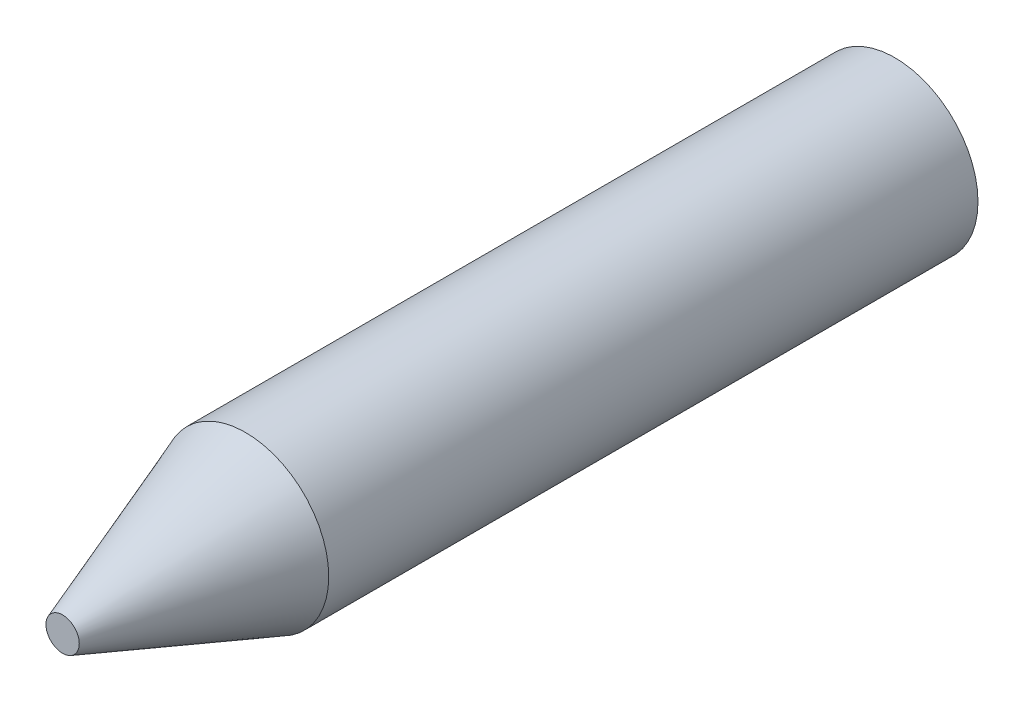
ISO-10303-21;
HEADER;
FILE_DESCRIPTION(('STEP AP214'),'2;1');
FILE_NAME('part.step','',(''),(''),'','','');
FILE_SCHEMA(('AUTOMOTIVE_DESIGN { 1 0 10303 214 1 1 1 1 }'));
ENDSEC;
DATA;
#1=APPLICATION_CONTEXT('core data for automotive mechanical design processes');
#2=APPLICATION_PROTOCOL_DEFINITION('international standard','automotive_design',2000,#1);
#3=PRODUCT_CONTEXT('',#1,'mechanical');
#4=PRODUCT('Part','Part','',(#3));
#5=PRODUCT_RELATED_PRODUCT_CATEGORY('part','',(#4));
#6=PRODUCT_DEFINITION_FORMATION('','',#4);
#7=PRODUCT_DEFINITION_CONTEXT('part definition',#1,'design');
#8=PRODUCT_DEFINITION('design','',#6,#7);
#9=PRODUCT_DEFINITION_SHAPE('','',#8);
#10=(LENGTH_UNIT() NAMED_UNIT(*) SI_UNIT(.MILLI.,.METRE.));
#11=(NAMED_UNIT(*) PLANE_ANGLE_UNIT() SI_UNIT($,.RADIAN.));
#12=(NAMED_UNIT(*) SI_UNIT($,.STERADIAN.) SOLID_ANGLE_UNIT());
#13=UNCERTAINTY_MEASURE_WITH_UNIT(LENGTH_MEASURE(1.E-05),#10,'distance_accuracy_value','');
#14=(GEOMETRIC_REPRESENTATION_CONTEXT(3) GLOBAL_UNCERTAINTY_ASSIGNED_CONTEXT((#13)) GLOBAL_UNIT_ASSIGNED_CONTEXT((#10,
#11,#12)) REPRESENTATION_CONTEXT('',''));
#15=CARTESIAN_POINT('',(0.,0.,0.));
#16=DIRECTION('',(0.,0.,1.));
#17=DIRECTION('',(1.,0.,0.));
#18=AXIS2_PLACEMENT_3D('',#15,#16,#17);
#19=CARTESIAN_POINT('',(0.,0.,-100.));
#20=DIRECTION('',(0.,0.,-1.));
#21=DIRECTION('',(-1.,0.,0.));
#22=AXIS2_PLACEMENT_3D('',#19,#20,#21);
#23=PLANE('',#22);
#24=CARTESIAN_POINT('',(0.,0.,-100.));
#25=DIRECTION('',(0.,0.,1.));
#26=DIRECTION('',(1.,0.,0.));
#27=AXIS2_PLACEMENT_3D('',#24,#25,#26);
#28=CIRCLE('',#27,10.);
#29=CARTESIAN_POINT('',(10.,0.,-100.));
#30=VERTEX_POINT('',#29);
#31=EDGE_CURVE('E10',#30,#30,#28,.T.);
#32=ORIENTED_EDGE('',*,*,#31,.F.);
#33=EDGE_LOOP('',(#32));
#34=FACE_BOUND('',#33,.T.);
#35=ADVANCED_FACE('F35',(#34),#23,.T.);
#36=CARTESIAN_POINT('',(0.,0.,68.6931684040079));
#37=DIRECTION('',(0.,0.,1.));
#38=DIRECTION('',(1.,0.,0.));
#39=AXIS2_PLACEMENT_3D('',#36,#37,#38);
#40=CYLINDRICAL_SURFACE('',#39,10.);
#41=ORIENTED_EDGE('',*,*,#31,.T.);
#42=EDGE_LOOP('',(#41));
#43=FACE_BOUND('',#42,.T.);
#44=CARTESIAN_POINT('',(0.,0.,-21.9798193556369));
#45=DIRECTION('',(0.,0.,1.));
#46=DIRECTION('',(1.,0.,0.));
#47=AXIS2_PLACEMENT_3D('',#44,#45,#46);
#48=CIRCLE('',#47,10.);
#49=CARTESIAN_POINT('',(10.,0.,-21.9798193556369));
#50=VERTEX_POINT('',#49);
#51=EDGE_CURVE('E41',#50,#50,#48,.T.);
#52=ORIENTED_EDGE('',*,*,#51,.F.);
#53=EDGE_LOOP('',(#52));
#54=FACE_BOUND('',#53,.T.);
#55=ADVANCED_FACE('F56',(#43,#54),#40,.T.);
#56=CARTESIAN_POINT('',(0.,0.,0.));
#57=DIRECTION('',(0.,0.,-1.));
#58=DIRECTION('',(-1.,0.,0.));
#59=AXIS2_PLACEMENT_3D('',#56,#57,#58);
#60=CONICAL_SURFACE('',#59,2.,0.349065850398867);
#61=ORIENTED_EDGE('',*,*,#51,.T.);
#62=EDGE_LOOP('',(#61));
#63=FACE_BOUND('',#62,.T.);
#64=CARTESIAN_POINT('',(0.,0.,0.));
#65=DIRECTION('',(0.,0.,1.));
#66=DIRECTION('',(1.,0.,0.));
#67=AXIS2_PLACEMENT_3D('',#64,#65,#66);
#68=CIRCLE('',#67,2.);
#69=CARTESIAN_POINT('',(2.,0.,0.));
#70=VERTEX_POINT('',#69);
#71=EDGE_CURVE('E45',#70,#70,#68,.T.);
#72=ORIENTED_EDGE('',*,*,#71,.F.);
#73=EDGE_LOOP('',(#72));
#74=FACE_BOUND('',#73,.T.);
#75=ADVANCED_FACE('F54',(#63,#74),#60,.T.);
#76=CARTESIAN_POINT('',(2.,0.,0.));
#77=DIRECTION('',(0.,0.,1.));
#78=DIRECTION('',(1.,0.,0.));
#79=AXIS2_PLACEMENT_3D('',#76,#77,#78);
#80=PLANE('',#79);
#81=ORIENTED_EDGE('',*,*,#71,.T.);
#82=EDGE_LOOP('',(#81));
#83=FACE_BOUND('',#82,.T.);
#84=ADVANCED_FACE('F52',(#83),#80,.T.);
#85=CLOSED_SHELL('',(#35,#55,#75,#84));
#86=MANIFOLD_SOLID_BREP('B2',#85);
#87=ADVANCED_BREP_SHAPE_REPRESENTATION('',(#18,#86),#14);
#88=SHAPE_DEFINITION_REPRESENTATION(#9,#87);
ENDSEC;
END-ISO-10303-21;
